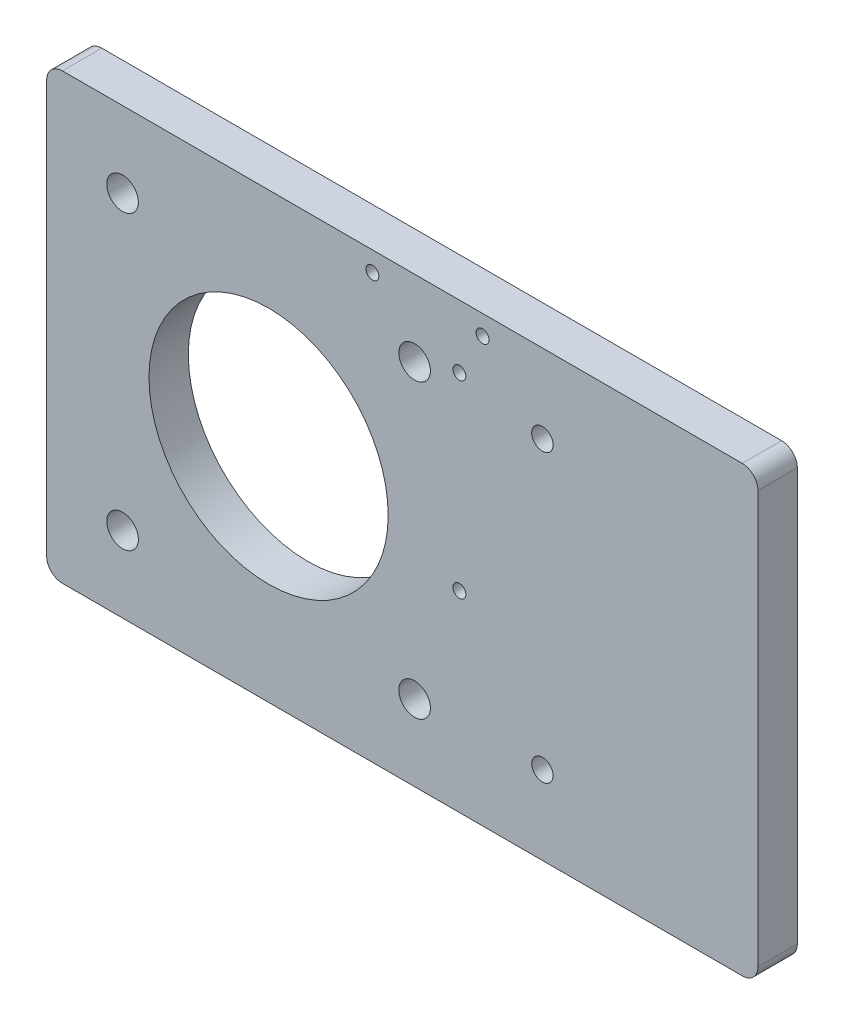
ISO-10303-21;
HEADER;
FILE_DESCRIPTION(('STEP AP214'),'2;1');
FILE_NAME('part.step','',(''),(''),'','','');
FILE_SCHEMA(('AUTOMOTIVE_DESIGN { 1 0 10303 214 1 1 1 1 }'));
ENDSEC;
DATA;
#1=APPLICATION_CONTEXT('core data for automotive mechanical design processes');
#2=APPLICATION_PROTOCOL_DEFINITION('international standard','automotive_design',2000,#1);
#3=PRODUCT_CONTEXT('',#1,'mechanical');
#4=PRODUCT('Part','Part','',(#3));
#5=PRODUCT_RELATED_PRODUCT_CATEGORY('part','',(#4));
#6=PRODUCT_DEFINITION_FORMATION('','',#4);
#7=PRODUCT_DEFINITION_CONTEXT('part definition',#1,'design');
#8=PRODUCT_DEFINITION('design','',#6,#7);
#9=PRODUCT_DEFINITION_SHAPE('','',#8);
#10=(LENGTH_UNIT() NAMED_UNIT(*) SI_UNIT(.MILLI.,.METRE.));
#11=(NAMED_UNIT(*) PLANE_ANGLE_UNIT() SI_UNIT($,.RADIAN.));
#12=(NAMED_UNIT(*) SI_UNIT($,.STERADIAN.) SOLID_ANGLE_UNIT());
#13=UNCERTAINTY_MEASURE_WITH_UNIT(LENGTH_MEASURE(1.E-05),#10,'distance_accuracy_value','');
#14=(GEOMETRIC_REPRESENTATION_CONTEXT(3) GLOBAL_UNCERTAINTY_ASSIGNED_CONTEXT((#13)) GLOBAL_UNIT_ASSIGNED_CONTEXT((#10,
#11,#12)) REPRESENTATION_CONTEXT('',''));
#15=CARTESIAN_POINT('',(0.,0.,0.));
#16=DIRECTION('',(0.,0.,1.));
#17=DIRECTION('',(1.,0.,0.));
#18=AXIS2_PLACEMENT_3D('',#15,#16,#17);
#19=CARTESIAN_POINT('',(76.46,33.28,6.35));
#20=DIRECTION('',(0.,0.,-1.));
#21=DIRECTION('',(-1.,0.,0.));
#22=AXIS2_PLACEMENT_3D('',#19,#20,#21);
#23=PLANE('',#22);
#24=CARTESIAN_POINT('',(44.202,23.12,6.35));
#25=DIRECTION('',(0.,0.,-1.));
#26=DIRECTION('',(-1.,0.,0.));
#27=AXIS2_PLACEMENT_3D('',#24,#25,#26);
#28=CIRCLE('',#27,1.7272);
#29=CARTESIAN_POINT('',(42.4748,23.12,6.35));
#30=VERTEX_POINT('',#29);
#31=EDGE_CURVE('E237',#30,#30,#28,.T.);
#32=ORIENTED_EDGE('',*,*,#31,.T.);
#33=EDGE_LOOP('',(#32));
#34=FACE_BOUND('',#33,.T.);
#35=CARTESIAN_POINT('',(44.202,-23.12,6.35));
#36=DIRECTION('',(0.,0.,-1.));
#37=DIRECTION('',(-1.,0.,0.));
#38=AXIS2_PLACEMENT_3D('',#35,#36,#37);
#39=CIRCLE('',#38,1.7272);
#40=CARTESIAN_POINT('',(42.4748,-23.12,6.35));
#41=VERTEX_POINT('',#40);
#42=EDGE_CURVE('E231',#41,#41,#39,.T.);
#43=ORIENTED_EDGE('',*,*,#42,.T.);
#44=EDGE_LOOP('',(#43));
#45=FACE_BOUND('',#44,.T.);
#46=CARTESIAN_POINT('',(30.8029,-4.82000000000001,6.35));
#47=DIRECTION('',(0.,0.,1.));
#48=DIRECTION('',(1.,0.,0.));
#49=AXIS2_PLACEMENT_3D('',#46,#47,#48);
#50=CIRCLE('',#49,1.04139999999999);
#51=CARTESIAN_POINT('',(31.8443,-4.82000000000001,6.35));
#52=VERTEX_POINT('',#51);
#53=EDGE_CURVE('E228',#52,#52,#50,.T.);
#54=ORIENTED_EDGE('',*,*,#53,.F.);
#55=EDGE_LOOP('',(#54));
#56=FACE_BOUND('',#55,.T.);
#57=CARTESIAN_POINT('',(34.544,32.645,6.35));
#58=DIRECTION('',(0.,0.,1.));
#59=DIRECTION('',(1.,0.,0.));
#60=AXIS2_PLACEMENT_3D('',#57,#58,#59);
#61=CIRCLE('',#60,1.04139999999999);
#62=CARTESIAN_POINT('',(35.5854,32.645,6.35));
#63=VERTEX_POINT('',#62);
#64=EDGE_CURVE('E222',#63,#63,#61,.T.);
#65=ORIENTED_EDGE('',*,*,#64,.F.);
#66=EDGE_LOOP('',(#65));
#67=FACE_BOUND('',#66,.T.);
#68=CARTESIAN_POINT('',(16.764,32.645,6.35));
#69=DIRECTION('',(0.,0.,1.));
#70=DIRECTION('',(1.,0.,0.));
#71=AXIS2_PLACEMENT_3D('',#68,#69,#70);
#72=CIRCLE('',#71,1.04139999999999);
#73=CARTESIAN_POINT('',(17.8054,32.645,6.35));
#74=VERTEX_POINT('',#73);
#75=EDGE_CURVE('E219',#74,#74,#72,.T.);
#76=ORIENTED_EDGE('',*,*,#75,.F.);
#77=EDGE_LOOP('',(#76));
#78=FACE_BOUND('',#77,.T.);
#79=CARTESIAN_POINT('',(30.8029,25.66,6.35));
#80=DIRECTION('',(0.,0.,1.));
#81=DIRECTION('',(1.,0.,0.));
#82=AXIS2_PLACEMENT_3D('',#79,#80,#81);
#83=CIRCLE('',#82,1.04139999999999);
#84=CARTESIAN_POINT('',(31.8443,25.66,6.35));
#85=VERTEX_POINT('',#84);
#86=EDGE_CURVE('E213',#85,#85,#83,.T.);
#87=ORIENTED_EDGE('',*,*,#86,.F.);
#88=EDGE_LOOP('',(#87));
#89=FACE_BOUND('',#88,.T.);
#90=CARTESIAN_POINT('',(-23.57,-23.57,6.35));
#91=DIRECTION('',(0.,0.,1.));
#92=DIRECTION('',(1.,0.,0.));
#93=AXIS2_PLACEMENT_3D('',#90,#91,#92);
#94=CIRCLE('',#93,2.55);
#95=CARTESIAN_POINT('',(-21.02,-23.57,6.35));
#96=VERTEX_POINT('',#95);
#97=EDGE_CURVE('E196',#96,#96,#94,.T.);
#98=ORIENTED_EDGE('',*,*,#97,.F.);
#99=EDGE_LOOP('',(#98));
#100=FACE_BOUND('',#99,.T.);
#101=CARTESIAN_POINT('',(23.57,23.57,6.35));
#102=DIRECTION('',(0.,0.,1.));
#103=DIRECTION('',(1.,0.,0.));
#104=AXIS2_PLACEMENT_3D('',#101,#102,#103);
#105=CIRCLE('',#104,2.55);
#106=CARTESIAN_POINT('',(26.12,23.57,6.35));
#107=VERTEX_POINT('',#106);
#108=EDGE_CURVE('E184',#107,#107,#105,.T.);
#109=ORIENTED_EDGE('',*,*,#108,.F.);
#110=EDGE_LOOP('',(#109));
#111=FACE_BOUND('',#110,.T.);
#112=CARTESIAN_POINT('',(76.46,33.28,6.35));
#113=DIRECTION('',(0.,0.,1.));
#114=DIRECTION('',(-1.,0.,0.));
#115=AXIS2_PLACEMENT_3D('',#112,#113,#114);
#116=CIRCLE('',#115,2.54);
#117=CARTESIAN_POINT('',(79.,33.28,6.35));
#118=VERTEX_POINT('',#117);
#119=CARTESIAN_POINT('',(76.46,35.82,6.35));
#120=VERTEX_POINT('',#119);
#121=EDGE_CURVE('E146',#118,#120,#116,.T.);
#122=ORIENTED_EDGE('',*,*,#121,.T.);
#123=DIRECTION('',(-1.,0.,0.));
#124=VECTOR('',#123,1.);
#125=CARTESIAN_POINT('',(-33.28,35.82,6.35));
#126=LINE('',#125,#124);
#127=CARTESIAN_POINT('',(-33.28,35.82,6.35));
#128=VERTEX_POINT('',#127);
#129=EDGE_CURVE('E94',#120,#128,#126,.T.);
#130=ORIENTED_EDGE('',*,*,#129,.T.);
#131=CARTESIAN_POINT('',(-33.28,33.28,6.35));
#132=DIRECTION('',(0.,0.,1.));
#133=DIRECTION('',(-1.,0.,0.));
#134=AXIS2_PLACEMENT_3D('',#131,#132,#133);
#135=CIRCLE('',#134,2.54);
#136=CARTESIAN_POINT('',(-35.82,33.28,6.35));
#137=VERTEX_POINT('',#136);
#138=EDGE_CURVE('E162',#128,#137,#135,.T.);
#139=ORIENTED_EDGE('',*,*,#138,.T.);
#140=DIRECTION('',(0.,-1.,0.));
#141=VECTOR('',#140,1.);
#142=CARTESIAN_POINT('',(-35.82,33.28,6.35));
#143=LINE('',#142,#141);
#144=CARTESIAN_POINT('',(-35.82,-33.28,6.35));
#145=VERTEX_POINT('',#144);
#146=EDGE_CURVE('E175',#137,#145,#143,.T.);
#147=ORIENTED_EDGE('',*,*,#146,.T.);
#148=CARTESIAN_POINT('',(-33.28,-33.28,6.35));
#149=DIRECTION('',(0.,0.,1.));
#150=DIRECTION('',(-1.,0.,0.));
#151=AXIS2_PLACEMENT_3D('',#148,#149,#150);
#152=CIRCLE('',#151,2.54);
#153=CARTESIAN_POINT('',(-33.28,-35.82,6.35));
#154=VERTEX_POINT('',#153);
#155=EDGE_CURVE('E113',#145,#154,#152,.T.);
#156=ORIENTED_EDGE('',*,*,#155,.T.);
#157=DIRECTION('',(1.,0.,0.));
#158=VECTOR('',#157,1.);
#159=CARTESIAN_POINT('',(-33.28,-35.82,6.35));
#160=LINE('',#159,#158);
#161=CARTESIAN_POINT('',(76.46,-35.82,6.35));
#162=VERTEX_POINT('',#161);
#163=EDGE_CURVE('E107',#154,#162,#160,.T.);
#164=ORIENTED_EDGE('',*,*,#163,.T.);
#165=CARTESIAN_POINT('',(76.46,-33.28,6.35));
#166=DIRECTION('',(0.,0.,1.));
#167=DIRECTION('',(-1.,0.,0.));
#168=AXIS2_PLACEMENT_3D('',#165,#166,#167);
#169=CIRCLE('',#168,2.54000000000001);
#170=CARTESIAN_POINT('',(79.,-33.28,6.35));
#171=VERTEX_POINT('',#170);
#172=EDGE_CURVE('E111',#162,#171,#169,.T.);
#173=ORIENTED_EDGE('',*,*,#172,.T.);
#174=DIRECTION('',(0.,1.,0.));
#175=VECTOR('',#174,1.);
#176=CARTESIAN_POINT('',(79.,33.28,6.35));
#177=LINE('',#176,#175);
#178=EDGE_CURVE('E51',#171,#118,#177,.T.);
#179=ORIENTED_EDGE('',*,*,#178,.T.);
#180=EDGE_LOOP('',(#122,#130,#139,#147,#156,#164,#173,#179));
#181=FACE_BOUND('',#180,.T.);
#182=CARTESIAN_POINT('',(0.,0.,6.35));
#183=DIRECTION('',(0.,0.,1.));
#184=DIRECTION('',(1.,0.,0.));
#185=AXIS2_PLACEMENT_3D('',#182,#183,#184);
#186=CIRCLE('',#185,19.304);
#187=CARTESIAN_POINT('',(19.304,0.,6.35));
#188=VERTEX_POINT('',#187);
#189=EDGE_CURVE('E135',#188,#188,#186,.T.);
#190=ORIENTED_EDGE('',*,*,#189,.F.);
#191=EDGE_LOOP('',(#190));
#192=FACE_BOUND('',#191,.T.);
#193=CARTESIAN_POINT('',(-23.57,23.57,6.35));
#194=DIRECTION('',(0.,0.,1.));
#195=DIRECTION('',(1.,0.,0.));
#196=AXIS2_PLACEMENT_3D('',#193,#194,#195);
#197=CIRCLE('',#196,2.55);
#198=CARTESIAN_POINT('',(-21.02,23.57,6.35));
#199=VERTEX_POINT('',#198);
#200=EDGE_CURVE('E190',#199,#199,#197,.T.);
#201=ORIENTED_EDGE('',*,*,#200,.F.);
#202=EDGE_LOOP('',(#201));
#203=FACE_BOUND('',#202,.T.);
#204=CARTESIAN_POINT('',(23.57,-23.57,6.35));
#205=DIRECTION('',(0.,0.,1.));
#206=DIRECTION('',(1.,0.,0.));
#207=AXIS2_PLACEMENT_3D('',#204,#205,#206);
#208=CIRCLE('',#207,2.55);
#209=CARTESIAN_POINT('',(26.12,-23.57,6.35));
#210=VERTEX_POINT('',#209);
#211=EDGE_CURVE('E202',#210,#210,#208,.T.);
#212=ORIENTED_EDGE('',*,*,#211,.F.);
#213=EDGE_LOOP('',(#212));
#214=FACE_BOUND('',#213,.T.);
#215=ADVANCED_FACE('F33',(#34,#45,#56,#67,#78,#89,#100,#111,#181,#192,#203,#214),#23,.F.);
#216=CARTESIAN_POINT('',(76.46,33.28,0.));
#217=DIRECTION('',(0.,0.,-1.));
#218=DIRECTION('',(-1.,0.,0.));
#219=AXIS2_PLACEMENT_3D('',#216,#217,#218);
#220=PLANE('',#219);
#221=CARTESIAN_POINT('',(44.202,23.12,0.));
#222=DIRECTION('',(0.,0.,-1.));
#223=DIRECTION('',(-1.,0.,0.));
#224=AXIS2_PLACEMENT_3D('',#221,#222,#223);
#225=CIRCLE('',#224,1.7272);
#226=CARTESIAN_POINT('',(42.4748,23.12,0.));
#227=VERTEX_POINT('',#226);
#228=EDGE_CURVE('E240',#227,#227,#225,.T.);
#229=ORIENTED_EDGE('',*,*,#228,.F.);
#230=EDGE_LOOP('',(#229));
#231=FACE_BOUND('',#230,.T.);
#232=CARTESIAN_POINT('',(44.202,-23.12,0.));
#233=DIRECTION('',(0.,0.,-1.));
#234=DIRECTION('',(-1.,0.,0.));
#235=AXIS2_PLACEMENT_3D('',#232,#233,#234);
#236=CIRCLE('',#235,1.7272);
#237=CARTESIAN_POINT('',(42.4748,-23.12,0.));
#238=VERTEX_POINT('',#237);
#239=EDGE_CURVE('E234',#238,#238,#236,.T.);
#240=ORIENTED_EDGE('',*,*,#239,.F.);
#241=EDGE_LOOP('',(#240));
#242=FACE_BOUND('',#241,.T.);
#243=CARTESIAN_POINT('',(30.8029,-4.82000000000001,0.));
#244=DIRECTION('',(0.,0.,-1.));
#245=DIRECTION('',(-1.,0.,0.));
#246=AXIS2_PLACEMENT_3D('',#243,#244,#245);
#247=CIRCLE('',#246,1.04139999999999);
#248=CARTESIAN_POINT('',(29.7615,-4.82000000000001,0.));
#249=VERTEX_POINT('',#248);
#250=EDGE_CURVE('E225',#249,#249,#247,.T.);
#251=ORIENTED_EDGE('',*,*,#250,.F.);
#252=EDGE_LOOP('',(#251));
#253=FACE_BOUND('',#252,.T.);
#254=CARTESIAN_POINT('',(34.544,32.645,0.));
#255=DIRECTION('',(0.,0.,-1.));
#256=DIRECTION('',(-1.,0.,0.));
#257=AXIS2_PLACEMENT_3D('',#254,#255,#256);
#258=CIRCLE('',#257,1.04139999999999);
#259=CARTESIAN_POINT('',(33.5026,32.645,0.));
#260=VERTEX_POINT('',#259);
#261=EDGE_CURVE('E37',#260,#260,#258,.T.);
#262=ORIENTED_EDGE('',*,*,#261,.F.);
#263=EDGE_LOOP('',(#262));
#264=FACE_BOUND('',#263,.T.);
#265=CARTESIAN_POINT('',(16.764,32.645,0.));
#266=DIRECTION('',(0.,0.,-1.));
#267=DIRECTION('',(-1.,0.,0.));
#268=AXIS2_PLACEMENT_3D('',#265,#266,#267);
#269=CIRCLE('',#268,1.04139999999999);
#270=CARTESIAN_POINT('',(15.7226,32.645,0.));
#271=VERTEX_POINT('',#270);
#272=EDGE_CURVE('E216',#271,#271,#269,.T.);
#273=ORIENTED_EDGE('',*,*,#272,.F.);
#274=EDGE_LOOP('',(#273));
#275=FACE_BOUND('',#274,.T.);
#276=CARTESIAN_POINT('',(30.8029,25.66,0.));
#277=DIRECTION('',(0.,0.,-1.));
#278=DIRECTION('',(-1.,0.,0.));
#279=AXIS2_PLACEMENT_3D('',#276,#277,#278);
#280=CIRCLE('',#279,1.04139999999999);
#281=CARTESIAN_POINT('',(29.7615,25.66,0.));
#282=VERTEX_POINT('',#281);
#283=EDGE_CURVE('E208',#282,#282,#280,.T.);
#284=ORIENTED_EDGE('',*,*,#283,.F.);
#285=EDGE_LOOP('',(#284));
#286=FACE_BOUND('',#285,.T.);
#287=CARTESIAN_POINT('',(-23.57,-23.57,0.));
#288=DIRECTION('',(0.,0.,1.));
#289=DIRECTION('',(1.,0.,0.));
#290=AXIS2_PLACEMENT_3D('',#287,#288,#289);
#291=CIRCLE('',#290,2.55);
#292=CARTESIAN_POINT('',(-21.02,-23.57,0.));
#293=VERTEX_POINT('',#292);
#294=EDGE_CURVE('E199',#293,#293,#291,.T.);
#295=ORIENTED_EDGE('',*,*,#294,.T.);
#296=EDGE_LOOP('',(#295));
#297=FACE_BOUND('',#296,.T.);
#298=CARTESIAN_POINT('',(23.57,23.57,0.));
#299=DIRECTION('',(0.,0.,1.));
#300=DIRECTION('',(1.,0.,0.));
#301=AXIS2_PLACEMENT_3D('',#298,#299,#300);
#302=CIRCLE('',#301,2.55);
#303=CARTESIAN_POINT('',(26.12,23.57,0.));
#304=VERTEX_POINT('',#303);
#305=EDGE_CURVE('E187',#304,#304,#302,.T.);
#306=ORIENTED_EDGE('',*,*,#305,.T.);
#307=EDGE_LOOP('',(#306));
#308=FACE_BOUND('',#307,.T.);
#309=CARTESIAN_POINT('',(76.46,33.28,0.));
#310=DIRECTION('',(0.,0.,1.));
#311=DIRECTION('',(-1.,0.,0.));
#312=AXIS2_PLACEMENT_3D('',#309,#310,#311);
#313=CIRCLE('',#312,2.54);
#314=CARTESIAN_POINT('',(79.,33.28,0.));
#315=VERTEX_POINT('',#314);
#316=CARTESIAN_POINT('',(76.46,35.82,0.));
#317=VERTEX_POINT('',#316);
#318=EDGE_CURVE('E131',#315,#317,#313,.T.);
#319=ORIENTED_EDGE('',*,*,#318,.F.);
#320=DIRECTION('',(0.,1.,0.));
#321=VECTOR('',#320,1.);
#322=CARTESIAN_POINT('',(79.,33.28,0.));
#323=LINE('',#322,#321);
#324=CARTESIAN_POINT('',(79.,-33.28,0.));
#325=VERTEX_POINT('',#324);
#326=EDGE_CURVE('E86',#325,#315,#323,.T.);
#327=ORIENTED_EDGE('',*,*,#326,.F.);
#328=CARTESIAN_POINT('',(76.46,-33.28,0.));
#329=DIRECTION('',(0.,0.,1.));
#330=DIRECTION('',(-1.,0.,0.));
#331=AXIS2_PLACEMENT_3D('',#328,#329,#330);
#332=CIRCLE('',#331,2.54000000000001);
#333=CARTESIAN_POINT('',(76.46,-35.82,0.));
#334=VERTEX_POINT('',#333);
#335=EDGE_CURVE('E80',#334,#325,#332,.T.);
#336=ORIENTED_EDGE('',*,*,#335,.F.);
#337=DIRECTION('',(1.,0.,0.));
#338=VECTOR('',#337,1.);
#339=CARTESIAN_POINT('',(-33.28,-35.82,0.));
#340=LINE('',#339,#338);
#341=CARTESIAN_POINT('',(-33.28,-35.82,0.));
#342=VERTEX_POINT('',#341);
#343=EDGE_CURVE('E121',#342,#334,#340,.T.);
#344=ORIENTED_EDGE('',*,*,#343,.F.);
#345=CARTESIAN_POINT('',(-33.28,-33.28,0.));
#346=DIRECTION('',(0.,0.,1.));
#347=DIRECTION('',(-1.,0.,0.));
#348=AXIS2_PLACEMENT_3D('',#345,#346,#347);
#349=CIRCLE('',#348,2.54);
#350=CARTESIAN_POINT('',(-35.82,-33.28,0.));
#351=VERTEX_POINT('',#350);
#352=EDGE_CURVE('E141',#351,#342,#349,.T.);
#353=ORIENTED_EDGE('',*,*,#352,.F.);
#354=DIRECTION('',(0.,-1.,0.));
#355=VECTOR('',#354,1.);
#356=CARTESIAN_POINT('',(-35.82,33.28,0.));
#357=LINE('',#356,#355);
#358=CARTESIAN_POINT('',(-35.82,33.28,0.));
#359=VERTEX_POINT('',#358);
#360=EDGE_CURVE('E139',#359,#351,#357,.T.);
#361=ORIENTED_EDGE('',*,*,#360,.F.);
#362=CARTESIAN_POINT('',(-33.28,33.28,0.));
#363=DIRECTION('',(0.,0.,1.));
#364=DIRECTION('',(-1.,0.,0.));
#365=AXIS2_PLACEMENT_3D('',#362,#363,#364);
#366=CIRCLE('',#365,2.54);
#367=CARTESIAN_POINT('',(-33.28,35.82,0.));
#368=VERTEX_POINT('',#367);
#369=EDGE_CURVE('E137',#368,#359,#366,.T.);
#370=ORIENTED_EDGE('',*,*,#369,.F.);
#371=DIRECTION('',(-1.,0.,0.));
#372=VECTOR('',#371,1.);
#373=CARTESIAN_POINT('',(-33.28,35.82,0.));
#374=LINE('',#373,#372);
#375=EDGE_CURVE('E134',#317,#368,#374,.T.);
#376=ORIENTED_EDGE('',*,*,#375,.F.);
#377=EDGE_LOOP('',(#319,#327,#336,#344,#353,#361,#370,#376));
#378=FACE_BOUND('',#377,.T.);
#379=CARTESIAN_POINT('',(0.,0.,0.));
#380=DIRECTION('',(0.,0.,1.));
#381=DIRECTION('',(1.,0.,0.));
#382=AXIS2_PLACEMENT_3D('',#379,#380,#381);
#383=CIRCLE('',#382,19.304);
#384=CARTESIAN_POINT('',(19.304,0.,0.));
#385=VERTEX_POINT('',#384);
#386=EDGE_CURVE('E181',#385,#385,#383,.T.);
#387=ORIENTED_EDGE('',*,*,#386,.T.);
#388=EDGE_LOOP('',(#387));
#389=FACE_BOUND('',#388,.T.);
#390=CARTESIAN_POINT('',(-23.57,23.57,0.));
#391=DIRECTION('',(0.,0.,1.));
#392=DIRECTION('',(1.,0.,0.));
#393=AXIS2_PLACEMENT_3D('',#390,#391,#392);
#394=CIRCLE('',#393,2.55);
#395=CARTESIAN_POINT('',(-21.02,23.57,0.));
#396=VERTEX_POINT('',#395);
#397=EDGE_CURVE('E193',#396,#396,#394,.T.);
#398=ORIENTED_EDGE('',*,*,#397,.T.);
#399=EDGE_LOOP('',(#398));
#400=FACE_BOUND('',#399,.T.);
#401=CARTESIAN_POINT('',(23.57,-23.57,0.));
#402=DIRECTION('',(0.,0.,1.));
#403=DIRECTION('',(1.,0.,0.));
#404=AXIS2_PLACEMENT_3D('',#401,#402,#403);
#405=CIRCLE('',#404,2.55);
#406=CARTESIAN_POINT('',(26.12,-23.57,0.));
#407=VERTEX_POINT('',#406);
#408=EDGE_CURVE('E205',#407,#407,#405,.T.);
#409=ORIENTED_EDGE('',*,*,#408,.T.);
#410=EDGE_LOOP('',(#409));
#411=FACE_BOUND('',#410,.T.);
#412=ADVANCED_FACE('F166',(#231,#242,#253,#264,#275,#286,#297,#308,#378,#389,#400,#411),#220,.T.);
#413=CARTESIAN_POINT('',(76.46,33.28,6.35));
#414=DIRECTION('',(0.,0.,-1.));
#415=DIRECTION('',(-1.,0.,0.));
#416=AXIS2_PLACEMENT_3D('',#413,#414,#415);
#417=CYLINDRICAL_SURFACE('',#416,2.54);
#418=ORIENTED_EDGE('',*,*,#318,.T.);
#419=DIRECTION('',(0.,0.,-1.));
#420=VECTOR('',#419,1.);
#421=CARTESIAN_POINT('',(76.46,35.82,6.35));
#422=LINE('',#421,#420);
#423=EDGE_CURVE('E11',#120,#317,#422,.T.);
#424=ORIENTED_EDGE('',*,*,#423,.F.);
#425=ORIENTED_EDGE('',*,*,#121,.F.);
#426=DIRECTION('',(0.,0.,-1.));
#427=VECTOR('',#426,1.);
#428=CARTESIAN_POINT('',(79.,33.28,6.35));
#429=LINE('',#428,#427);
#430=EDGE_CURVE('E127',#118,#315,#429,.T.);
#431=ORIENTED_EDGE('',*,*,#430,.T.);
#432=EDGE_LOOP('',(#418,#424,#425,#431));
#433=FACE_BOUND('',#432,.T.);
#434=ADVANCED_FACE('F35',(#433),#417,.T.);
#435=CARTESIAN_POINT('',(-33.28,35.82,6.35));
#436=DIRECTION('',(0.,-1.,0.));
#437=DIRECTION('',(0.,0.,-1.));
#438=AXIS2_PLACEMENT_3D('',#435,#436,#437);
#439=PLANE('',#438);
#440=ORIENTED_EDGE('',*,*,#375,.T.);
#441=DIRECTION('',(0.,0.,-1.));
#442=VECTOR('',#441,1.);
#443=CARTESIAN_POINT('',(-33.28,35.82,6.35));
#444=LINE('',#443,#442);
#445=EDGE_CURVE('E43',#128,#368,#444,.T.);
#446=ORIENTED_EDGE('',*,*,#445,.F.);
#447=ORIENTED_EDGE('',*,*,#129,.F.);
#448=ORIENTED_EDGE('',*,*,#423,.T.);
#449=EDGE_LOOP('',(#440,#446,#447,#448));
#450=FACE_BOUND('',#449,.T.);
#451=ADVANCED_FACE('F298',(#450),#439,.F.);
#452=CARTESIAN_POINT('',(-33.28,33.28,6.35));
#453=DIRECTION('',(0.,0.,-1.));
#454=DIRECTION('',(-1.,0.,0.));
#455=AXIS2_PLACEMENT_3D('',#452,#453,#454);
#456=CYLINDRICAL_SURFACE('',#455,2.54);
#457=ORIENTED_EDGE('',*,*,#369,.T.);
#458=DIRECTION('',(0.,0.,-1.));
#459=VECTOR('',#458,1.);
#460=CARTESIAN_POINT('',(-35.82,33.28,6.35));
#461=LINE('',#460,#459);
#462=EDGE_CURVE('E153',#137,#359,#461,.T.);
#463=ORIENTED_EDGE('',*,*,#462,.F.);
#464=ORIENTED_EDGE('',*,*,#138,.F.);
#465=ORIENTED_EDGE('',*,*,#445,.T.);
#466=EDGE_LOOP('',(#457,#463,#464,#465));
#467=FACE_BOUND('',#466,.T.);
#468=ADVANCED_FACE('F160',(#467),#456,.T.);
#469=CARTESIAN_POINT('',(-35.82,33.28,6.35));
#470=DIRECTION('',(1.,0.,0.));
#471=DIRECTION('',(0.,1.,0.));
#472=AXIS2_PLACEMENT_3D('',#469,#470,#471);
#473=PLANE('',#472);
#474=ORIENTED_EDGE('',*,*,#360,.T.);
#475=DIRECTION('',(0.,0.,-1.));
#476=VECTOR('',#475,1.);
#477=CARTESIAN_POINT('',(-35.82,-33.28,6.35));
#478=LINE('',#477,#476);
#479=EDGE_CURVE('E150',#145,#351,#478,.T.);
#480=ORIENTED_EDGE('',*,*,#479,.F.);
#481=ORIENTED_EDGE('',*,*,#146,.F.);
#482=ORIENTED_EDGE('',*,*,#462,.T.);
#483=EDGE_LOOP('',(#474,#480,#481,#482));
#484=FACE_BOUND('',#483,.T.);
#485=ADVANCED_FACE('F171',(#484),#473,.F.);
#486=CARTESIAN_POINT('',(-33.28,-33.28,6.35));
#487=DIRECTION('',(0.,0.,-1.));
#488=DIRECTION('',(-1.,0.,0.));
#489=AXIS2_PLACEMENT_3D('',#486,#487,#488);
#490=CYLINDRICAL_SURFACE('',#489,2.54);
#491=ORIENTED_EDGE('',*,*,#352,.T.);
#492=DIRECTION('',(0.,0.,-1.));
#493=VECTOR('',#492,1.);
#494=CARTESIAN_POINT('',(-33.28,-35.82,6.35));
#495=LINE('',#494,#493);
#496=EDGE_CURVE('E122',#154,#342,#495,.T.);
#497=ORIENTED_EDGE('',*,*,#496,.F.);
#498=ORIENTED_EDGE('',*,*,#155,.F.);
#499=ORIENTED_EDGE('',*,*,#479,.T.);
#500=EDGE_LOOP('',(#491,#497,#498,#499));
#501=FACE_BOUND('',#500,.T.);
#502=ADVANCED_FACE('F174',(#501),#490,.T.);
#503=CARTESIAN_POINT('',(-33.28,-35.82,6.35));
#504=DIRECTION('',(0.,1.,0.));
#505=DIRECTION('',(0.,0.,1.));
#506=AXIS2_PLACEMENT_3D('',#503,#504,#505);
#507=PLANE('',#506);
#508=ORIENTED_EDGE('',*,*,#343,.T.);
#509=DIRECTION('',(0.,0.,-1.));
#510=VECTOR('',#509,1.);
#511=CARTESIAN_POINT('',(76.46,-35.82,6.35));
#512=LINE('',#511,#510);
#513=EDGE_CURVE('E118',#162,#334,#512,.T.);
#514=ORIENTED_EDGE('',*,*,#513,.F.);
#515=ORIENTED_EDGE('',*,*,#163,.F.);
#516=ORIENTED_EDGE('',*,*,#496,.T.);
#517=EDGE_LOOP('',(#508,#514,#515,#516));
#518=FACE_BOUND('',#517,.T.);
#519=ADVANCED_FACE('F119',(#518),#507,.F.);
#520=CARTESIAN_POINT('',(76.46,-33.28,6.35));
#521=DIRECTION('',(0.,0.,-1.));
#522=DIRECTION('',(-1.,0.,0.));
#523=AXIS2_PLACEMENT_3D('',#520,#521,#522);
#524=CYLINDRICAL_SURFACE('',#523,2.54000000000001);
#525=ORIENTED_EDGE('',*,*,#335,.T.);
#526=DIRECTION('',(0.,0.,-1.));
#527=VECTOR('',#526,1.);
#528=CARTESIAN_POINT('',(79.,-33.28,6.35));
#529=LINE('',#528,#527);
#530=EDGE_CURVE('E123',#171,#325,#529,.T.);
#531=ORIENTED_EDGE('',*,*,#530,.F.);
#532=ORIENTED_EDGE('',*,*,#172,.F.);
#533=ORIENTED_EDGE('',*,*,#513,.T.);
#534=EDGE_LOOP('',(#525,#531,#532,#533));
#535=FACE_BOUND('',#534,.T.);
#536=ADVANCED_FACE('F125',(#535),#524,.T.);
#537=CARTESIAN_POINT('',(79.,33.28,6.35));
#538=DIRECTION('',(-1.,0.,0.));
#539=DIRECTION('',(0.,-1.,0.));
#540=AXIS2_PLACEMENT_3D('',#537,#538,#539);
#541=PLANE('',#540);
#542=ORIENTED_EDGE('',*,*,#326,.T.);
#543=ORIENTED_EDGE('',*,*,#430,.F.);
#544=ORIENTED_EDGE('',*,*,#178,.F.);
#545=ORIENTED_EDGE('',*,*,#530,.T.);
#546=EDGE_LOOP('',(#542,#543,#544,#545));
#547=FACE_BOUND('',#546,.T.);
#548=ADVANCED_FACE('F277',(#547),#541,.F.);
#549=CARTESIAN_POINT('',(0.,0.,6.35));
#550=DIRECTION('',(0.,0.,-1.));
#551=DIRECTION('',(-1.,0.,0.));
#552=AXIS2_PLACEMENT_3D('',#549,#550,#551);
#553=CYLINDRICAL_SURFACE('',#552,19.304);
#554=ORIENTED_EDGE('',*,*,#189,.T.);
#555=EDGE_LOOP('',(#554));
#556=FACE_BOUND('',#555,.T.);
#557=ORIENTED_EDGE('',*,*,#386,.F.);
#558=EDGE_LOOP('',(#557));
#559=FACE_BOUND('',#558,.T.);
#560=ADVANCED_FACE('F267',(#556,#559),#553,.F.);
#561=CARTESIAN_POINT('',(23.57,23.57,6.35));
#562=DIRECTION('',(0.,0.,-1.));
#563=DIRECTION('',(-1.,0.,0.));
#564=AXIS2_PLACEMENT_3D('',#561,#562,#563);
#565=CYLINDRICAL_SURFACE('',#564,2.55);
#566=ORIENTED_EDGE('',*,*,#108,.T.);
#567=EDGE_LOOP('',(#566));
#568=FACE_BOUND('',#567,.T.);
#569=ORIENTED_EDGE('',*,*,#305,.F.);
#570=EDGE_LOOP('',(#569));
#571=FACE_BOUND('',#570,.T.);
#572=ADVANCED_FACE('F264',(#568,#571),#565,.F.);
#573=CARTESIAN_POINT('',(-23.57,23.57,6.35));
#574=DIRECTION('',(0.,0.,-1.));
#575=DIRECTION('',(-1.,0.,0.));
#576=AXIS2_PLACEMENT_3D('',#573,#574,#575);
#577=CYLINDRICAL_SURFACE('',#576,2.55);
#578=ORIENTED_EDGE('',*,*,#200,.T.);
#579=EDGE_LOOP('',(#578));
#580=FACE_BOUND('',#579,.T.);
#581=ORIENTED_EDGE('',*,*,#397,.F.);
#582=EDGE_LOOP('',(#581));
#583=FACE_BOUND('',#582,.T.);
#584=ADVANCED_FACE('F266',(#580,#583),#577,.F.);
#585=CARTESIAN_POINT('',(-23.57,-23.57,6.35));
#586=DIRECTION('',(0.,0.,-1.));
#587=DIRECTION('',(-1.,0.,0.));
#588=AXIS2_PLACEMENT_3D('',#585,#586,#587);
#589=CYLINDRICAL_SURFACE('',#588,2.55);
#590=ORIENTED_EDGE('',*,*,#97,.T.);
#591=EDGE_LOOP('',(#590));
#592=FACE_BOUND('',#591,.T.);
#593=ORIENTED_EDGE('',*,*,#294,.F.);
#594=EDGE_LOOP('',(#593));
#595=FACE_BOUND('',#594,.T.);
#596=ADVANCED_FACE('F274',(#592,#595),#589,.F.);
#597=CARTESIAN_POINT('',(23.57,-23.57,6.35));
#598=DIRECTION('',(0.,0.,-1.));
#599=DIRECTION('',(-1.,0.,0.));
#600=AXIS2_PLACEMENT_3D('',#597,#598,#599);
#601=CYLINDRICAL_SURFACE('',#600,2.55);
#602=ORIENTED_EDGE('',*,*,#211,.T.);
#603=EDGE_LOOP('',(#602));
#604=FACE_BOUND('',#603,.T.);
#605=ORIENTED_EDGE('',*,*,#408,.F.);
#606=EDGE_LOOP('',(#605));
#607=FACE_BOUND('',#606,.T.);
#608=ADVANCED_FACE('F356',(#604,#607),#601,.F.);
#609=CARTESIAN_POINT('',(30.8029,25.66,6.35));
#610=DIRECTION('',(0.,0.,1.));
#611=DIRECTION('',(1.,0.,0.));
#612=AXIS2_PLACEMENT_3D('',#609,#610,#611);
#613=CYLINDRICAL_SURFACE('',#612,1.04139999999999);
#614=ORIENTED_EDGE('',*,*,#283,.T.);
#615=EDGE_LOOP('',(#614));
#616=FACE_BOUND('',#615,.T.);
#617=ORIENTED_EDGE('',*,*,#86,.T.);
#618=EDGE_LOOP('',(#617));
#619=FACE_BOUND('',#618,.T.);
#620=ADVANCED_FACE('F352',(#616,#619),#613,.F.);
#621=CARTESIAN_POINT('',(16.764,32.645,6.35));
#622=DIRECTION('',(0.,0.,1.));
#623=DIRECTION('',(1.,0.,0.));
#624=AXIS2_PLACEMENT_3D('',#621,#622,#623);
#625=CYLINDRICAL_SURFACE('',#624,1.04139999999999);
#626=ORIENTED_EDGE('',*,*,#272,.T.);
#627=EDGE_LOOP('',(#626));
#628=FACE_BOUND('',#627,.T.);
#629=ORIENTED_EDGE('',*,*,#75,.T.);
#630=EDGE_LOOP('',(#629));
#631=FACE_BOUND('',#630,.T.);
#632=ADVANCED_FACE('F348',(#628,#631),#625,.F.);
#633=CARTESIAN_POINT('',(34.544,32.645,6.35));
#634=DIRECTION('',(0.,0.,1.));
#635=DIRECTION('',(1.,0.,0.));
#636=AXIS2_PLACEMENT_3D('',#633,#634,#635);
#637=CYLINDRICAL_SURFACE('',#636,1.04139999999999);
#638=ORIENTED_EDGE('',*,*,#261,.T.);
#639=EDGE_LOOP('',(#638));
#640=FACE_BOUND('',#639,.T.);
#641=ORIENTED_EDGE('',*,*,#64,.T.);
#642=EDGE_LOOP('',(#641));
#643=FACE_BOUND('',#642,.T.);
#644=ADVANCED_FACE('F344',(#640,#643),#637,.F.);
#645=CARTESIAN_POINT('',(30.8029,-4.82000000000001,6.35));
#646=DIRECTION('',(0.,0.,1.));
#647=DIRECTION('',(1.,0.,0.));
#648=AXIS2_PLACEMENT_3D('',#645,#646,#647);
#649=CYLINDRICAL_SURFACE('',#648,1.04139999999999);
#650=ORIENTED_EDGE('',*,*,#250,.T.);
#651=EDGE_LOOP('',(#650));
#652=FACE_BOUND('',#651,.T.);
#653=ORIENTED_EDGE('',*,*,#53,.T.);
#654=EDGE_LOOP('',(#653));
#655=FACE_BOUND('',#654,.T.);
#656=ADVANCED_FACE('F325',(#652,#655),#649,.F.);
#657=CARTESIAN_POINT('',(44.202,-23.12,0.));
#658=DIRECTION('',(0.,0.,-1.));
#659=DIRECTION('',(-1.,0.,0.));
#660=AXIS2_PLACEMENT_3D('',#657,#658,#659);
#661=CYLINDRICAL_SURFACE('',#660,1.7272);
#662=ORIENTED_EDGE('',*,*,#42,.F.);
#663=EDGE_LOOP('',(#662));
#664=FACE_BOUND('',#663,.T.);
#665=ORIENTED_EDGE('',*,*,#239,.T.);
#666=EDGE_LOOP('',(#665));
#667=FACE_BOUND('',#666,.T.);
#668=ADVANCED_FACE('F320',(#664,#667),#661,.F.);
#669=CARTESIAN_POINT('',(44.202,23.12,0.));
#670=DIRECTION('',(0.,0.,-1.));
#671=DIRECTION('',(-1.,0.,0.));
#672=AXIS2_PLACEMENT_3D('',#669,#670,#671);
#673=CYLINDRICAL_SURFACE('',#672,1.7272);
#674=ORIENTED_EDGE('',*,*,#31,.F.);
#675=EDGE_LOOP('',(#674));
#676=FACE_BOUND('',#675,.T.);
#677=ORIENTED_EDGE('',*,*,#228,.T.);
#678=EDGE_LOOP('',(#677));
#679=FACE_BOUND('',#678,.T.);
#680=ADVANCED_FACE('F244',(#676,#679),#673,.F.);
#681=CLOSED_SHELL('',(#215,#412,#434,#451,#468,#485,#502,#519,#536,#548,#560,#572,#584,#596,
#608,#620,#632,#644,#656,#668,#680));
#682=MANIFOLD_SOLID_BREP('B2',#681);
#683=ADVANCED_BREP_SHAPE_REPRESENTATION('',(#18,#682),#14);
#684=SHAPE_DEFINITION_REPRESENTATION(#9,#683);
ENDSEC;
END-ISO-10303-21;
